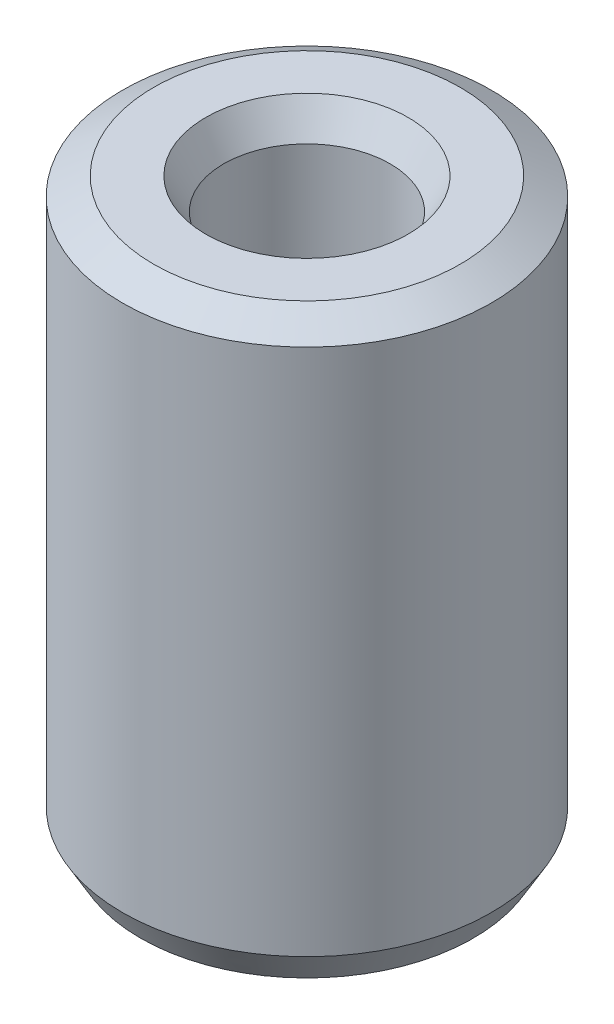
ISO-10303-21;
HEADER;
FILE_DESCRIPTION(('STEP AP214'),'2;1');
FILE_NAME('part.step','',(''),(''),'','','');
FILE_SCHEMA(('AUTOMOTIVE_DESIGN { 1 0 10303 214 1 1 1 1 }'));
ENDSEC;
DATA;
#1=APPLICATION_CONTEXT('core data for automotive mechanical design processes');
#2=APPLICATION_PROTOCOL_DEFINITION('international standard','automotive_design',2000,#1);
#3=PRODUCT_CONTEXT('',#1,'mechanical');
#4=PRODUCT('Part','Part','',(#3));
#5=PRODUCT_RELATED_PRODUCT_CATEGORY('part','',(#4));
#6=PRODUCT_DEFINITION_FORMATION('','',#4);
#7=PRODUCT_DEFINITION_CONTEXT('part definition',#1,'design');
#8=PRODUCT_DEFINITION('design','',#6,#7);
#9=PRODUCT_DEFINITION_SHAPE('','',#8);
#10=(LENGTH_UNIT() NAMED_UNIT(*) SI_UNIT(.MILLI.,.METRE.));
#11=(NAMED_UNIT(*) PLANE_ANGLE_UNIT() SI_UNIT($,.RADIAN.));
#12=(NAMED_UNIT(*) SI_UNIT($,.STERADIAN.) SOLID_ANGLE_UNIT());
#13=UNCERTAINTY_MEASURE_WITH_UNIT(LENGTH_MEASURE(1.E-05),#10,'distance_accuracy_value','');
#14=(GEOMETRIC_REPRESENTATION_CONTEXT(3) GLOBAL_UNCERTAINTY_ASSIGNED_CONTEXT((#13)) GLOBAL_UNIT_ASSIGNED_CONTEXT((#10,
#11,#12)) REPRESENTATION_CONTEXT('',''));
#15=CARTESIAN_POINT('',(0.,0.,0.));
#16=DIRECTION('',(0.,0.,1.));
#17=DIRECTION('',(1.,0.,0.));
#18=AXIS2_PLACEMENT_3D('',#15,#16,#17);
#19=CARTESIAN_POINT('',(0.,62.5792510851449,0.));
#20=DIRECTION('',(0.,-1.,0.));
#21=DIRECTION('',(0.,0.,-1.));
#22=AXIS2_PLACEMENT_3D('',#19,#20,#21);
#23=CYLINDRICAL_SURFACE('',#22,20.);
#24=CARTESIAN_POINT('',(0.,3.37932469619994,0.));
#25=DIRECTION('',(0.,1.,0.));
#26=DIRECTION('',(0.,0.,1.));
#27=AXIS2_PLACEMENT_3D('',#24,#25,#26);
#28=CIRCLE('',#27,20.);
#29=CARTESIAN_POINT('',(0.,3.37932469619994,20.));
#30=VERTEX_POINT('',#29);
#31=EDGE_CURVE('E10',#30,#30,#28,.T.);
#32=ORIENTED_EDGE('',*,*,#31,.T.);
#33=EDGE_LOOP('',(#32));
#34=FACE_BOUND('',#33,.T.);
#35=CARTESIAN_POINT('',(0.,60.6281970621147,0.));
#36=DIRECTION('',(0.,1.,0.));
#37=DIRECTION('',(0.,0.,1.));
#38=AXIS2_PLACEMENT_3D('',#35,#36,#37);
#39=CIRCLE('',#38,20.);
#40=CARTESIAN_POINT('',(0.,60.6281970621147,20.));
#41=VERTEX_POINT('',#40);
#42=EDGE_CURVE('E50',#41,#41,#39,.F.);
#43=ORIENTED_EDGE('',*,*,#42,.T.);
#44=EDGE_LOOP('',(#43));
#45=FACE_BOUND('',#44,.T.);
#46=ADVANCED_FACE('F39',(#34,#45),#23,.T.);
#47=CARTESIAN_POINT('',(0.,62.5792510851449,0.));
#48=DIRECTION('',(0.,1.,0.));
#49=DIRECTION('',(0.,0.,1.));
#50=AXIS2_PLACEMENT_3D('',#47,#48,#49);
#51=PLANE('',#50);
#52=CARTESIAN_POINT('',(0.,62.5792510851449,0.));
#53=DIRECTION('',(0.,1.,0.));
#54=DIRECTION('',(0.,0.,1.));
#55=AXIS2_PLACEMENT_3D('',#52,#53,#54);
#56=CIRCLE('',#55,10.9740403097639);
#57=CARTESIAN_POINT('',(0.,62.5792510851449,10.9740403097639));
#58=VERTEX_POINT('',#57);
#59=EDGE_CURVE('E58',#58,#58,#56,.F.);
#60=ORIENTED_EDGE('',*,*,#59,.T.);
#61=EDGE_LOOP('',(#60));
#62=FACE_BOUND('',#61,.T.);
#63=CARTESIAN_POINT('',(0.,62.5792510851449,0.));
#64=DIRECTION('',(0.,1.,0.));
#65=DIRECTION('',(0.,0.,1.));
#66=AXIS2_PLACEMENT_3D('',#63,#64,#65);
#67=CIRCLE('',#66,16.6206753038);
#68=CARTESIAN_POINT('',(0.,62.5792510851449,16.6206753038));
#69=VERTEX_POINT('',#68);
#70=EDGE_CURVE('E61',#69,#69,#67,.T.);
#71=ORIENTED_EDGE('',*,*,#70,.T.);
#72=EDGE_LOOP('',(#71));
#73=FACE_BOUND('',#72,.T.);
#74=ADVANCED_FACE('F88',(#62,#73),#51,.T.);
#75=CARTESIAN_POINT('',(0.,0.,0.));
#76=DIRECTION('',(0.,1.,0.));
#77=DIRECTION('',(0.,0.,1.));
#78=AXIS2_PLACEMENT_3D('',#75,#76,#77);
#79=PLANE('',#78);
#80=CARTESIAN_POINT('',(0.,0.,0.));
#81=DIRECTION('',(0.,1.,0.));
#82=DIRECTION('',(0.,0.,1.));
#83=AXIS2_PLACEMENT_3D('',#80,#81,#82);
#84=CIRCLE('',#83,12.4023109829336);
#85=CARTESIAN_POINT('',(0.,0.,12.4023109829336));
#86=VERTEX_POINT('',#85);
#87=EDGE_CURVE('E51',#86,#86,#84,.T.);
#88=ORIENTED_EDGE('',*,*,#87,.T.);
#89=EDGE_LOOP('',(#88));
#90=FACE_BOUND('',#89,.T.);
#91=CARTESIAN_POINT('',(0.,0.,0.));
#92=DIRECTION('',(0.,1.,0.));
#93=DIRECTION('',(0.,0.,1.));
#94=AXIS2_PLACEMENT_3D('',#91,#92,#93);
#95=CIRCLE('',#94,18.0489459769698);
#96=CARTESIAN_POINT('',(0.,0.,18.0489459769698));
#97=VERTEX_POINT('',#96);
#98=EDGE_CURVE('E54',#97,#97,#95,.F.);
#99=ORIENTED_EDGE('',*,*,#98,.T.);
#100=EDGE_LOOP('',(#99));
#101=FACE_BOUND('',#100,.T.);
#102=ADVANCED_FACE('F83',(#90,#101),#79,.F.);
#103=CARTESIAN_POINT('',(0.,62.5792510851449,0.));
#104=DIRECTION('',(0.,-1.,0.));
#105=DIRECTION('',(0.,0.,-1.));
#106=AXIS2_PLACEMENT_3D('',#103,#104,#105);
#107=CYLINDRICAL_SURFACE('',#106,9.02298628673363);
#108=CARTESIAN_POINT('',(0.,59.1999263889449,0.));
#109=DIRECTION('',(0.,1.,0.));
#110=DIRECTION('',(0.,0.,1.));
#111=AXIS2_PLACEMENT_3D('',#108,#109,#110);
#112=CIRCLE('',#111,9.02298628673363);
#113=CARTESIAN_POINT('',(0.,59.1999263889449,9.02298628673363));
#114=VERTEX_POINT('',#113);
#115=EDGE_CURVE('E67',#114,#114,#112,.T.);
#116=ORIENTED_EDGE('',*,*,#115,.T.);
#117=EDGE_LOOP('',(#116));
#118=FACE_BOUND('',#117,.T.);
#119=CARTESIAN_POINT('',(0.,1.95105402303021,0.));
#120=DIRECTION('',(0.,1.,0.));
#121=DIRECTION('',(0.,0.,1.));
#122=AXIS2_PLACEMENT_3D('',#119,#120,#121);
#123=CIRCLE('',#122,9.02298628673363);
#124=CARTESIAN_POINT('',(0.,1.95105402303021,9.02298628673363));
#125=VERTEX_POINT('',#124);
#126=EDGE_CURVE('E69',#125,#125,#123,.F.);
#127=ORIENTED_EDGE('',*,*,#126,.T.);
#128=EDGE_LOOP('',(#127));
#129=FACE_BOUND('',#128,.T.);
#130=ADVANCED_FACE('F71',(#118,#129),#107,.F.);
#131=CARTESIAN_POINT('',(0.,59.1999263889449,0.));
#132=DIRECTION('',(0.,1.,0.));
#133=DIRECTION('',(0.,0.,1.));
#134=AXIS2_PLACEMENT_3D('',#131,#132,#133);
#135=CONICAL_SURFACE('',#134,9.02298628673363,0.5235987755983);
#136=ORIENTED_EDGE('',*,*,#59,.F.);
#137=EDGE_LOOP('',(#136));
#138=FACE_BOUND('',#137,.T.);
#139=ORIENTED_EDGE('',*,*,#115,.F.);
#140=EDGE_LOOP('',(#139));
#141=FACE_BOUND('',#140,.T.);
#142=ADVANCED_FACE('F77',(#138,#141),#135,.F.);
#143=CARTESIAN_POINT('',(0.,0.,0.));
#144=DIRECTION('',(0.,-1.,0.));
#145=DIRECTION('',(0.,0.,-1.));
#146=AXIS2_PLACEMENT_3D('',#143,#144,#145);
#147=CONICAL_SURFACE('',#146,12.4023109829336,1.04719755119659);
#148=ORIENTED_EDGE('',*,*,#126,.F.);
#149=EDGE_LOOP('',(#148));
#150=FACE_BOUND('',#149,.T.);
#151=ORIENTED_EDGE('',*,*,#87,.F.);
#152=EDGE_LOOP('',(#151));
#153=FACE_BOUND('',#152,.T.);
#154=ADVANCED_FACE('F73',(#150,#153),#147,.F.);
#155=CARTESIAN_POINT('',(0.,3.37932469619994,0.));
#156=DIRECTION('',(0.,1.,0.));
#157=DIRECTION('',(0.,0.,1.));
#158=AXIS2_PLACEMENT_3D('',#155,#156,#157);
#159=CONICAL_SURFACE('',#158,20.,0.523598775598303);
#160=CARTESIAN_POINT('',(0.,0.,18.0489459769698));
#161=CARTESIAN_POINT('',(0.,0.0352012989187491,18.0692694563764));
#162=CARTESIAN_POINT('',(0.,0.0704025978374985,18.0895929357829));
#163=CARTESIAN_POINT('',(0.,0.140805195674997,18.1302398945961));
#164=CARTESIAN_POINT('',(0.,0.176006494593747,18.1505633740026));
#165=CARTESIAN_POINT('',(0.,0.246409092431245,18.1912103328157));
#166=CARTESIAN_POINT('',(0.,0.281610391349995,18.2115338122223));
#167=CARTESIAN_POINT('',(0.,0.352012989187494,18.2521807710354));
#168=CARTESIAN_POINT('',(0.,0.387214288106243,18.272504250442));
#169=CARTESIAN_POINT('',(0.,0.457616885943742,18.3131512092551));
#170=CARTESIAN_POINT('',(0.,0.492818184862491,18.3334746886617));
#171=CARTESIAN_POINT('',(0.,0.56322078269999,18.3741216474748));
#172=CARTESIAN_POINT('',(0.,0.598422081618739,18.3944451268814));
#173=CARTESIAN_POINT('',(0.,0.668824679456238,18.4350920856945));
#174=CARTESIAN_POINT('',(0.,0.704025978374988,18.4554155651011));
#175=CARTESIAN_POINT('',(0.,0.774428576212486,18.4960625239142));
#176=CARTESIAN_POINT('',(0.,0.809629875131235,18.5163860033208));
#177=CARTESIAN_POINT('',(0.,0.880032472968734,18.5570329621339));
#178=CARTESIAN_POINT('',(0.,0.915233771887484,18.5773564415405));
#179=CARTESIAN_POINT('',(0.,0.985636369724983,18.6180034003536));
#180=CARTESIAN_POINT('',(0.,1.02083766864373,18.6383268797602));
#181=CARTESIAN_POINT('',(0.,1.09124026648123,18.6789738385733));
#182=CARTESIAN_POINT('',(0.,1.12644156539998,18.6992973179799));
#183=CARTESIAN_POINT('',(0.,1.19684416323748,18.739944276793));
#184=CARTESIAN_POINT('',(0.,1.23204546215623,18.7602677561996));
#185=CARTESIAN_POINT('',(0.,1.30244805999373,18.8009147150127));
#186=CARTESIAN_POINT('',(0.,1.33764935891248,18.8212381944193));
#187=CARTESIAN_POINT('',(0.,1.40805195674998,18.8618851532324));
#188=CARTESIAN_POINT('',(0.,1.44325325566872,18.8822086326389));
#189=CARTESIAN_POINT('',(0.,1.51365585350622,18.9228555914521));
#190=CARTESIAN_POINT('',(0.,1.54885715242497,18.9431790708586));
#191=CARTESIAN_POINT('',(0.,1.61925975026247,18.9838260296718));
#192=CARTESIAN_POINT('',(0.,1.65446104918122,19.0041495090783));
#193=CARTESIAN_POINT('',(0.,1.72486364701872,19.0447964678915));
#194=CARTESIAN_POINT('',(0.,1.76006494593747,19.065119947298));
#195=CARTESIAN_POINT('',(0.,1.83046754377497,19.1057669061112));
#196=CARTESIAN_POINT('',(0.,1.86566884269372,19.1260903855177));
#197=CARTESIAN_POINT('',(0.,1.93607144053122,19.1667373443309));
#198=CARTESIAN_POINT('',(0.,1.97127273944997,19.1870608237374));
#199=CARTESIAN_POINT('',(0.,2.04167533728746,19.2277077825505));
#200=CARTESIAN_POINT('',(0.,2.07687663620621,19.2480312619571));
#201=CARTESIAN_POINT('',(0.,2.14727923404371,19.2886782207702));
#202=CARTESIAN_POINT('',(0.,2.18248053296246,19.3090017001768));
#203=CARTESIAN_POINT('',(0.,2.25288313079996,19.3496486589899));
#204=CARTESIAN_POINT('',(0.,2.28808442971871,19.3699721383965));
#205=CARTESIAN_POINT('',(0.,2.35848702755621,19.4106190972096));
#206=CARTESIAN_POINT('',(0.,2.39368832647496,19.4309425766162));
#207=CARTESIAN_POINT('',(0.,2.46409092431246,19.4715895354293));
#208=CARTESIAN_POINT('',(0.,2.49929222323121,19.4919130148359));
#209=CARTESIAN_POINT('',(0.,2.56969482106871,19.532559973649));
#210=CARTESIAN_POINT('',(0.,2.60489611998745,19.5528834530556));
#211=CARTESIAN_POINT('',(0.,2.67529871782495,19.5935304118687));
#212=CARTESIAN_POINT('',(0.,2.7105000167437,19.6138538912753));
#213=CARTESIAN_POINT('',(0.,2.7809026145812,19.6545008500884));
#214=CARTESIAN_POINT('',(0.,2.81610391349995,19.674824329495));
#215=CARTESIAN_POINT('',(0.,2.88650651133745,19.7154712883081));
#216=CARTESIAN_POINT('',(0.,2.9217078102562,19.7357947677147));
#217=CARTESIAN_POINT('',(0.,2.9921104080937,19.7764417265278));
#218=CARTESIAN_POINT('',(0.,3.02731170701245,19.7967652059344));
#219=CARTESIAN_POINT('',(0.,3.09771430484995,19.8374121647475));
#220=CARTESIAN_POINT('',(0.,3.1329156037687,19.857735644154));
#221=CARTESIAN_POINT('',(0.,3.20331820160619,19.8983826029672));
#222=CARTESIAN_POINT('',(0.,3.23851950052494,19.9187060823737));
#223=CARTESIAN_POINT('',(0.,3.30892209836244,19.9593530411869));
#224=CARTESIAN_POINT('',(0.,3.34412339728119,19.9796765205934));
#225=CARTESIAN_POINT('',(0.,3.37932469619994,20.));
#226=B_SPLINE_CURVE_WITH_KNOTS('',3,(#160,#161,#162,#163,#164,#165,#166,#167,#168,#169,#170,
#171,#172,#173,#174,#175,#176,#177,#178,#179,#180,#181,#182,#183,#184,#185,#186,#187,#188,#189,
#190,#191,#192,#193,#194,#195,#196,#197,#198,#199,#200,#201,#202,#203,#204,#205,#206,#207,#208,
#209,#210,#211,#212,#213,#214,#215,#216,#217,#218,#219,#220,#221,#222,#223,#224,#225),
.UNSPECIFIED.,.F.,.F.,(4,2,2,2,2,2,2,2,2,2,2,2,2,2,2,2,2,2,2,2,2,2,2,2,2,2,2,2,2,2,2,2,4),(0.,
0.121940876439387,0.243881752878774,0.365822629318161,0.487763505757547,0.609704382196934,
0.731645258636321,0.853586135075708,0.975527011515094,1.09746788795448,1.21940876439387,
1.34134964083326,1.46329051727264,1.58523139371203,1.70717227015142,1.8291131465908,
1.95105402303019,2.07299489946958,2.19493577590896,2.31687665234835,2.43881752878774,
2.56075840522713,2.68269928166651,2.8046401581059,2.92658103454529,3.04852191098467,
3.17046278742406,3.29240366386345,3.41434454030283,3.53628541674222,3.65822629318161,
3.78016716962099,3.90210804606038),.UNSPECIFIED.);
#227=EDGE_CURVE('BSEAM76',#97,#30,#226,.T.);
#228=ORIENTED_EDGE('',*,*,#98,.F.);
#229=ORIENTED_EDGE('',*,*,#31,.F.);
#230=ORIENTED_EDGE('',*,*,#227,.T.);
#231=ORIENTED_EDGE('',*,*,#227,.F.);
#232=EDGE_LOOP('',(#228,#230,#229,#231));
#233=FACE_BOUND('',#232,.T.);
#234=ADVANCED_FACE('F76',(#233),#159,.T.);
#235=CARTESIAN_POINT('',(0.,62.5792510851449,0.));
#236=DIRECTION('',(0.,-1.,0.));
#237=DIRECTION('',(0.,0.,-1.));
#238=AXIS2_PLACEMENT_3D('',#235,#236,#237);
#239=CONICAL_SURFACE('',#238,16.6206753038,1.04719755119659);
#240=ORIENTED_EDGE('',*,*,#42,.F.);
#241=EDGE_LOOP('',(#240));
#242=FACE_BOUND('',#241,.T.);
#243=ORIENTED_EDGE('',*,*,#70,.F.);
#244=EDGE_LOOP('',(#243));
#245=FACE_BOUND('',#244,.T.);
#246=ADVANCED_FACE('F45',(#242,#245),#239,.T.);
#247=CLOSED_SHELL('',(#46,#74,#102,#130,#142,#154,#234,#246));
#248=MANIFOLD_SOLID_BREP('B2',#247);
#249=ADVANCED_BREP_SHAPE_REPRESENTATION('',(#18,#248),#14);
#250=SHAPE_DEFINITION_REPRESENTATION(#9,#249);
ENDSEC;
END-ISO-10303-21;
